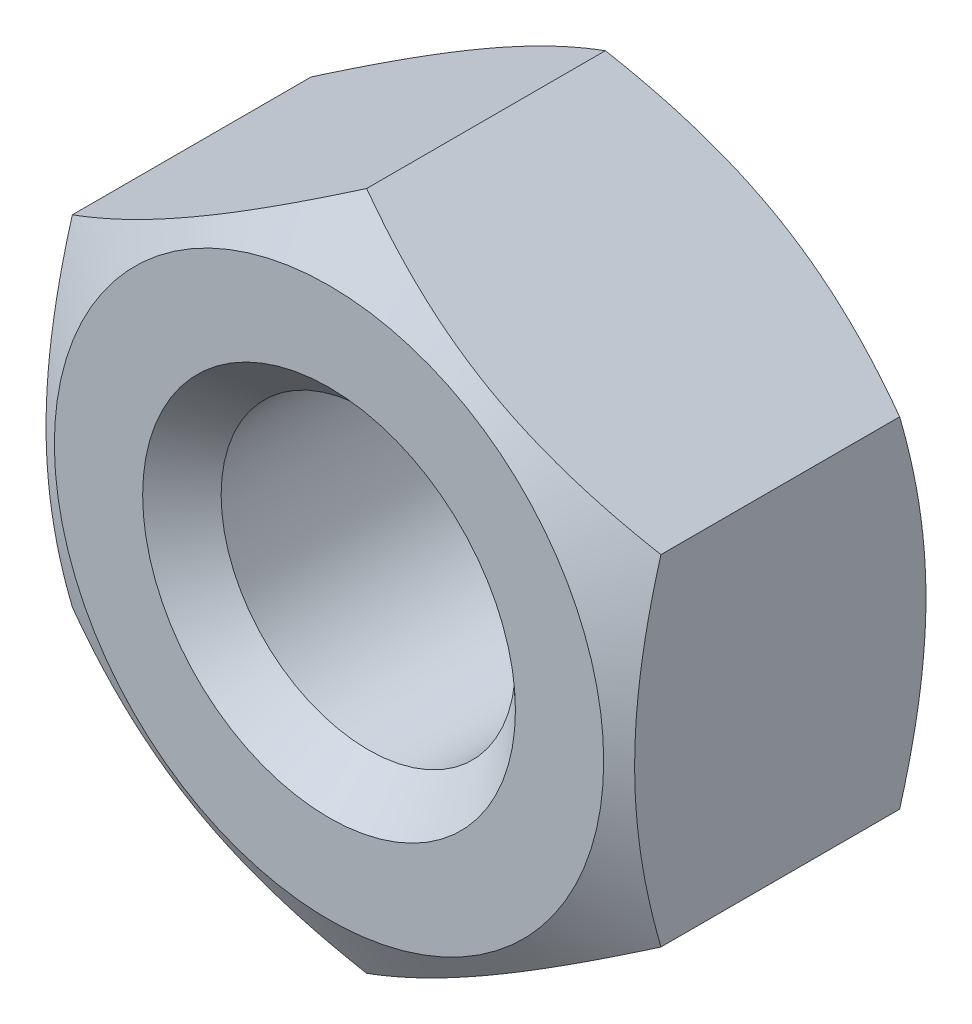
ISO-10303-21;
HEADER;
FILE_DESCRIPTION(('STEP AP214'),'2;1');
FILE_NAME('part.step','',(''),(''),'','','');
FILE_SCHEMA(('AUTOMOTIVE_DESIGN { 1 0 10303 214 1 1 1 1 }'));
ENDSEC;
DATA;
#1=APPLICATION_CONTEXT('core data for automotive mechanical design processes');
#2=APPLICATION_PROTOCOL_DEFINITION('international standard','automotive_design',2000,#1);
#3=PRODUCT_CONTEXT('',#1,'mechanical');
#4=PRODUCT('Part','Part','',(#3));
#5=PRODUCT_RELATED_PRODUCT_CATEGORY('part','',(#4));
#6=PRODUCT_DEFINITION_FORMATION('','',#4);
#7=PRODUCT_DEFINITION_CONTEXT('part definition',#1,'design');
#8=PRODUCT_DEFINITION('design','',#6,#7);
#9=PRODUCT_DEFINITION_SHAPE('','',#8);
#10=(LENGTH_UNIT() NAMED_UNIT(*) SI_UNIT(.MILLI.,.METRE.));
#11=(NAMED_UNIT(*) PLANE_ANGLE_UNIT() SI_UNIT($,.RADIAN.));
#12=(NAMED_UNIT(*) SI_UNIT($,.STERADIAN.) SOLID_ANGLE_UNIT());
#13=UNCERTAINTY_MEASURE_WITH_UNIT(LENGTH_MEASURE(1.E-05),#10,'distance_accuracy_value','');
#14=(GEOMETRIC_REPRESENTATION_CONTEXT(3) GLOBAL_UNCERTAINTY_ASSIGNED_CONTEXT((#13)) GLOBAL_UNIT_ASSIGNED_CONTEXT((#10,
#11,#12)) REPRESENTATION_CONTEXT('',''));
#15=CARTESIAN_POINT('',(0.,0.,0.));
#16=DIRECTION('',(0.,0.,1.));
#17=DIRECTION('',(1.,0.,0.));
#18=AXIS2_PLACEMENT_3D('',#15,#16,#17);
#19=CARTESIAN_POINT('',(0.,0.,0.));
#20=DIRECTION('',(0.,0.,-1.));
#21=DIRECTION('',(-1.00000000000015,0.,0.));
#22=AXIS2_PLACEMENT_3D('',#19,#20,#21);
#23=PLANE('',#22);
#24=CARTESIAN_POINT('',(0.,0.,0.));
#25=DIRECTION('',(0.,0.,-1.));
#26=DIRECTION('',(-1.00000000000015,0.,0.));
#27=AXIS2_PLACEMENT_3D('',#24,#25,#26);
#28=CIRCLE('',#27,1.9);
#29=CARTESIAN_POINT('',(-1.90000000000028,0.,0.));
#30=VERTEX_POINT('',#29);
#31=EDGE_CURVE('E122',#30,#30,#28,.T.);
#32=ORIENTED_EDGE('',*,*,#31,.T.);
#33=EDGE_LOOP('',(#32));
#34=FACE_BOUND('',#33,.T.);
#35=CARTESIAN_POINT('',(0.,0.,0.));
#36=DIRECTION('',(0.,0.,1.));
#37=DIRECTION('',(1.00000000000015,0.,0.));
#38=AXIS2_PLACEMENT_3D('',#35,#36,#37);
#39=CIRCLE('',#38,2.8);
#40=CARTESIAN_POINT('',(2.80000000000041,0.,0.));
#41=VERTEX_POINT('',#40);
#42=EDGE_CURVE('E243',#41,#41,#39,.T.);
#43=ORIENTED_EDGE('',*,*,#42,.T.);
#44=EDGE_LOOP('',(#43));
#45=FACE_BOUND('',#44,.T.);
#46=ADVANCED_FACE('F35',(#34,#45),#23,.F.);
#47=CARTESIAN_POINT('',(-1.2490009027033E-12,-7.19910242530375E-13,-3.20000000000001));
#48=DIRECTION('',(0.,0.,1.));
#49=DIRECTION('',(1.00000000000015,0.,0.));
#50=AXIS2_PLACEMENT_3D('',#47,#48,#49);
#51=PLANE('',#50);
#52=CARTESIAN_POINT('',(-1.2490009027033E-12,-7.19910242530375E-13,-3.20000000000001));
#53=DIRECTION('',(0.,0.,1.));
#54=DIRECTION('',(1.00000000000015,0.,0.));
#55=AXIS2_PLACEMENT_3D('',#52,#53,#54);
#56=CIRCLE('',#55,1.9);
#57=CARTESIAN_POINT('',(1.89999999999903,-7.18802795063311E-13,-3.20000000000001));
#58=VERTEX_POINT('',#57);
#59=EDGE_CURVE('E12',#58,#58,#56,.T.);
#60=ORIENTED_EDGE('',*,*,#59,.T.);
#61=EDGE_LOOP('',(#60));
#62=FACE_BOUND('',#61,.T.);
#63=CARTESIAN_POINT('',(-1.2490009027033E-12,-7.19910242530375E-13,-3.20000000000001));
#64=DIRECTION('',(0.,0.,1.));
#65=DIRECTION('',(1.00000000000015,0.,0.));
#66=AXIS2_PLACEMENT_3D('',#63,#64,#65);
#67=CIRCLE('',#66,2.8);
#68=CARTESIAN_POINT('',(2.79999999999917,-7.18278214684176E-13,-3.20000000000001));
#69=VERTEX_POINT('',#68);
#70=EDGE_CURVE('E242',#69,#69,#67,.T.);
#71=ORIENTED_EDGE('',*,*,#70,.F.);
#72=EDGE_LOOP('',(#71));
#73=FACE_BOUND('',#72,.T.);
#74=ADVANCED_FACE('F208',(#62,#73),#51,.F.);
#75=CARTESIAN_POINT('',(-1.2490009027033E-12,-7.19910242530375E-13,-3.20000000000001));
#76=DIRECTION('',(0.,0.,1.));
#77=DIRECTION('',(1.00000000000015,0.,0.));
#78=AXIS2_PLACEMENT_3D('',#75,#76,#77);
#79=CYLINDRICAL_SURFACE('',#78,1.5);
#80=CARTESIAN_POINT('',(0.,0.,-0.399999999999984));
#81=DIRECTION('',(0.,0.,-1.));
#82=DIRECTION('',(-1.00000000000015,0.,0.));
#83=AXIS2_PLACEMENT_3D('',#80,#81,#82);
#84=CIRCLE('',#83,1.5);
#85=CARTESIAN_POINT('',(-1.50000000000022,0.,-0.399999999999984));
#86=VERTEX_POINT('',#85);
#87=EDGE_CURVE('E43',#86,#86,#84,.F.);
#88=ORIENTED_EDGE('',*,*,#87,.T.);
#89=EDGE_LOOP('',(#88));
#90=FACE_BOUND('',#89,.T.);
#91=CARTESIAN_POINT('',(-2.91433543964104E-12,1.38777878078145E-12,-2.8));
#92=DIRECTION('',(0.,0.,1.));
#93=DIRECTION('',(1.00000000000015,0.,0.));
#94=AXIS2_PLACEMENT_3D('',#91,#92,#93);
#95=CIRCLE('',#94,1.5);
#96=CARTESIAN_POINT('',(1.49999999999731,1.38865308141334E-12,-2.8));
#97=VERTEX_POINT('',#96);
#98=EDGE_CURVE('E234',#97,#97,#95,.F.);
#99=ORIENTED_EDGE('',*,*,#98,.T.);
#100=EDGE_LOOP('',(#99));
#101=FACE_BOUND('',#100,.T.);
#102=ADVANCED_FACE('F205',(#90,#101),#79,.F.);
#103=CARTESIAN_POINT('',(-2.91433543964104E-12,1.38777878078145E-12,-2.81658075373095));
#104=DIRECTION('',(0.,0.,1.));
#105=DIRECTION('',(1.00000000000015,0.,0.));
#106=AXIS2_PLACEMENT_3D('',#103,#104,#105);
#107=CONICAL_SURFACE('',#106,3.46410161513776,1.0471975511966);
#108=ORIENTED_EDGE('',*,*,#70,.T.);
#109=EDGE_LOOP('',(#108));
#110=FACE_BOUND('',#109,.T.);
#111=CARTESIAN_POINT('',(-0.000200000000505351,-3.46421708519094,-2.8165140837311));
#112=CARTESIAN_POINT('',(0.131635206586424,-3.38810199317681,-2.86047624171016));
#113=CARTESIAN_POINT('',(0.264608405352933,-3.31132988107363,-2.90045835986991));
#114=CARTESIAN_POINT('',(0.532857419999334,-3.15645624025793,-2.97024786571702));
#115=CARTESIAN_POINT('',(0.668138002631622,-3.07835195945963,-3.00003056389698));
#116=CARTESIAN_POINT('',(0.937022602092664,-2.92311136357846,-3.04639210695105));
#117=CARTESIAN_POINT('',(1.07058524542457,-2.8459989354952,-3.06327950503942));
#118=CARTESIAN_POINT('',(1.33833905729256,-2.69141120014185,-3.0834403037137));
#119=CARTESIAN_POINT('',(1.47252925247954,-2.61393645483512,-3.08673039838093));
#120=CARTESIAN_POINT('',(1.72327559769503,-2.46916798492557,-3.07988941527675));
#121=CARTESIAN_POINT('',(1.83986926496939,-2.40185259973261,-3.07143803196976));
#122=CARTESIAN_POINT('',(2.07229698496979,-2.26766039301866,-3.04465100315551));
#123=CARTESIAN_POINT('',(2.18813023364743,-2.20078403571524,-3.02630620530075));
#124=CARTESIAN_POINT('',(2.42103725705337,-2.06631510305682,-2.98044519530902));
#125=CARTESIAN_POINT('',(2.53808155051088,-1.9987395487214,-2.95273456089922));
#126=CARTESIAN_POINT('',(2.77042435049651,-1.8645963706055,-2.8898421510248));
#127=CARTESIAN_POINT('',(2.885725834169,-1.79802702796991,-2.85467515514058));
#128=CARTESIAN_POINT('',(3.00019999999948,-1.7319353375156,-2.81651408373104));
#129=B_SPLINE_CURVE_WITH_KNOTS('',3,(#111,#112,#113,#114,#115,#116,#117,#118,#119,#120,#121,
#122,#123,#124,#125,#126,#127,#128),.UNSPECIFIED.,.F.,.F.,(4,2,2,2,2,2,2,2,4),(0.,
0.475539830102213,0.952222784106223,1.41710776961029,1.88142182297686,2.28572436315824,
2.69040156474842,3.10405572063451,3.51689749407022),.UNSPECIFIED.);
#130=CARTESIAN_POINT('',(-3.02535774210355E-12,-3.46410161513691,-2.81658075373095));
#131=VERTEX_POINT('',#130);
#132=CARTESIAN_POINT('',(2.99999999999998,-1.73205080756907,-2.81658075373095));
#133=VERTEX_POINT('',#132);
#134=EDGE_CURVE('E246',#131,#133,#129,.T.);
#135=ORIENTED_EDGE('',*,*,#134,.F.);
#136=CARTESIAN_POINT('',(-3.00020000000109,-1.7319353375129,-2.81651408373104));
#137=CARTESIAN_POINT('',(-2.86836479341274,-1.80805042952527,-2.86047624171042));
#138=CARTESIAN_POINT('',(-2.73539159464588,-1.8848225416286,-2.90045835987033));
#139=CARTESIAN_POINT('',(-2.4671425799991,-2.0396961824452,-2.97024786571762));
#140=CARTESIAN_POINT('',(-2.33186199736679,-2.11780046324424,-3.0000305638976));
#141=CARTESIAN_POINT('',(-2.06297739790416,-2.27304105912422,-3.04639210695175));
#142=CARTESIAN_POINT('',(-1.92941475457074,-2.35015348720562,-3.06327950504018));
#143=CARTESIAN_POINT('',(-1.66166094270534,-2.50474122256503,-3.08344030371415));
#144=CARTESIAN_POINT('',(-1.52747074752247,-2.58221596787967,-3.08673039838102));
#145=CARTESIAN_POINT('',(-1.27672440230623,-2.72698443778809,-3.07988941527665));
#146=CARTESIAN_POINT('',(-1.16013073502817,-2.79429982297402,-3.07143803196982));
#147=CARTESIAN_POINT('',(-0.927703015025435,-2.92849202968265,-3.04465100315563));
#148=CARTESIAN_POINT('',(-0.811869766349163,-2.99536838698777,-3.02630620530079));
#149=CARTESIAN_POINT('',(-0.578962742944541,-3.12983731964713,-2.98044519530902));
#150=CARTESIAN_POINT('',(-0.46191844948695,-3.19741287398173,-2.95273456089928));
#151=CARTESIAN_POINT('',(-0.229575649501911,-3.33155605209731,-2.88984215102494));
#152=CARTESIAN_POINT('',(-0.114274165830091,-3.3981253947334,-2.85467515514074));
#153=CARTESIAN_POINT('',(0.000199999998201639,-3.46421708519079,-2.8165140837311));
#154=B_SPLINE_CURVE_WITH_KNOTS('',3,(#136,#137,#138,#139,#140,#141,#142,#143,#144,#145,#146,
#147,#148,#149,#150,#151,#152,#153),.UNSPECIFIED.,.F.,.F.,(4,2,2,2,2,2,2,2,4),(0.,
0.475539830103452,0.952222784108633,1.41710776961384,1.88142182298158,2.28572436316202,
2.69040156475124,3.10405572063631,3.51689749407104),.UNSPECIFIED.);
#155=CARTESIAN_POINT('',(-3.0000000000015,-1.73205080756687,-2.81658075373095));
#156=VERTEX_POINT('',#155);
#157=EDGE_CURVE('E191',#156,#131,#154,.T.);
#158=ORIENTED_EDGE('',*,*,#157,.F.);
#159=CARTESIAN_POINT('',(-3.00000000000145,-4.57765749511687,-1.65667842704484));
#160=CARTESIAN_POINT('',(-3.0000000000015,-4.44606427833543,-1.72020492915937));
#161=CARTESIAN_POINT('',(-3.00000000000152,-4.31415811418956,-1.78309500271883));
#162=CARTESIAN_POINT('',(-3.00000000000153,-4.04955060360331,-1.90723823648846));
#163=CARTESIAN_POINT('',(-3.00000000000153,-3.91684912259699,-1.96849110953371));
#164=CARTESIAN_POINT('',(-3.00000000000152,-3.64975690282372,-2.08932207615049));
#165=CARTESIAN_POINT('',(-3.00000000000153,-3.51536083247075,-2.14888842738215));
#166=CARTESIAN_POINT('',(-3.00000000000153,-3.24545813842675,-2.26543945696922));
#167=CARTESIAN_POINT('',(-3.00000000000153,-3.109951573615,-2.32242427116727));
#168=CARTESIAN_POINT('',(-3.00000000000153,-2.83600490472254,-2.43377106655771));
#169=CARTESIAN_POINT('',(-3.00000000000152,-2.69754903322078,-2.4880944695001));
#170=CARTESIAN_POINT('',(-3.00000000000153,-2.418998525444,-2.59244658673362));
#171=CARTESIAN_POINT('',(-3.00000000000155,-2.27890370825794,-2.64247482173243));
#172=CARTESIAN_POINT('',(-3.00000000000151,-1.99714555154741,-2.7368806564095));
#173=CARTESIAN_POINT('',(-3.00000000000144,-1.85548632687972,-2.7812704106576));
#174=CARTESIAN_POINT('',(-3.00000000000161,-1.57015481262822,-2.86294732647327));
#175=CARTESIAN_POINT('',(-3.00000000000183,-1.42648317933591,-2.90023674827005));
#176=CARTESIAN_POINT('',(-3.00000000000183,-1.13702234190613,-2.9658940729883));
#177=CARTESIAN_POINT('',(-3.00000000000161,-0.991232392231981,-2.99425875119487));
#178=CARTESIAN_POINT('',(-3.00000000000145,-0.697912819732321,-3.04014317644817));
#179=CARTESIAN_POINT('',(-3.00000000000151,-0.550383192374841,-3.05766289523677));
#180=CARTESIAN_POINT('',(-3.00000000000155,-0.255278853966281,-3.08030714442248));
#181=CARTESIAN_POINT('',(-3.00000000000153,-0.107710188699163,-3.08550846769668));
#182=CARTESIAN_POINT('',(-3.00000000000153,0.187297365842236,-3.08324668788049));
#183=CARTESIAN_POINT('',(-3.00000000000156,0.334736278512527,-3.07578679048925));
#184=CARTESIAN_POINT('',(-3.00000000000155,0.586954835131567,-3.05271713094714));
#185=CARTESIAN_POINT('',(-3.00000000000154,0.692014181849801,-3.0400065707226));
#186=CARTESIAN_POINT('',(-3.00000000000152,0.901310176422364,-3.00899150516465));
#187=CARTESIAN_POINT('',(-3.00000000000153,1.00554669773543,-2.99068615597004));
#188=CARTESIAN_POINT('',(-3.00000000000153,1.31718924319225,-2.9282897762209));
#189=CARTESIAN_POINT('',(-3.00000000000153,1.52311968843158,-2.87676052617172));
#190=CARTESIAN_POINT('',(-3.00000000000153,1.83112795815375,-2.78804538997541));
#191=CARTESIAN_POINT('',(-3.00000000000153,1.93481734916386,-2.75614146716544));
#192=CARTESIAN_POINT('',(-3.00000000000153,2.14119424047152,-2.68918565647907));
#193=CARTESIAN_POINT('',(-3.00000000000152,2.24388165015759,-2.65413348677146));
#194=CARTESIAN_POINT('',(-3.00000000000154,2.44774194404171,-2.58162985632623));
#195=CARTESIAN_POINT('',(-3.00000000000155,2.54892011094915,-2.54419309966778));
#196=CARTESIAN_POINT('',(-3.00000000000151,2.75041771709734,-2.46717289178836));
#197=CARTESIAN_POINT('',(-3.00000000000145,2.85073744024708,-2.42759018478115));
#198=CARTESIAN_POINT('',(-3.00000000000131,2.95069606960836,-2.38713587233771));
#199=B_SPLINE_CURVE_WITH_KNOTS('',3,(#159,#160,#161,#162,#163,#164,#165,#166,#167,#168,#169,
#170,#171,#172,#173,#174,#175,#176,#177,#178,#179,#180,#181,#182,#183,#184,#185,#186,#187,#188,
#189,#190,#191,#192,#193,#194,#195,#196,#197,#198),.UNSPECIFIED.,.F.,.F.,(4,2,2,2,2,2,2,2,2,2,2,
2,2,2,2,2,2,2,2,4),(0.,0.43837969628058,0.876835786366916,1.31782905096681,1.7587990831173,
2.20493854325159,2.65112772298676,3.09633813670552,3.54140659002272,3.98663567261508,
4.43186591531249,4.8743132015646,5.31664848113509,5.63396971840568,5.95133884083178,
6.58730373269214,6.91273838994946,7.23820220922469,7.56182376655392,7.88533380132694),.UNSPECIFIED.);
#200=CARTESIAN_POINT('',(-3.00000000000161,1.73205080757159,-2.81658075373095));
#201=VERTEX_POINT('',#200);
#202=EDGE_CURVE('E185',#201,#156,#199,.F.);
#203=ORIENTED_EDGE('',*,*,#202,.F.);
#204=CARTESIAN_POINT('',(0.000199999998201639,3.46421708519352,-2.81651408373107));
#205=CARTESIAN_POINT('',(-0.131635206591242,3.38810199318231,-2.86047624170901));
#206=CARTESIAN_POINT('',(-0.26460840535848,3.3113298810793,-2.90045835986848));
#207=CARTESIAN_POINT('',(-0.532857420005614,3.15645624026276,-2.97024786571559));
#208=CARTESIAN_POINT('',(-0.668138002637909,3.07835195946345,-3.00003056389583));
#209=CARTESIAN_POINT('',(-0.937022602100865,2.92311136358358,-3.04639210694987));
#210=CARTESIAN_POINT('',(-1.07058524543463,2.84599893550254,-3.06327950503794));
#211=CARTESIAN_POINT('',(-1.33833905729955,2.69141120014201,-3.0834403037129));
#212=CARTESIAN_POINT('',(-1.47252925248162,2.61393645482588,-3.08673039838112));
#213=CARTESIAN_POINT('',(-1.72327559769774,2.46916798491782,-3.07988941527662));
#214=CARTESIAN_POINT('',(-1.83986926497628,2.40185259973334,-3.07143803196869));
#215=CARTESIAN_POINT('',(-2.07229698497911,2.26766039302592,-3.04465100315382));
#216=CARTESIAN_POINT('',(-2.18813023365501,2.20078403572053,-3.02630620529938));
#217=CARTESIAN_POINT('',(-2.42103725705916,2.06631510306113,-2.98044519530807));
#218=CARTESIAN_POINT('',(-2.53808155051666,1.99873954872676,-2.95273456089835));
#219=CARTESIAN_POINT('',(-2.77042435050133,1.86459637061136,-2.88984215102422));
#220=CARTESIAN_POINT('',(-2.88572583417287,1.79802702797524,-2.85467515514021));
#221=CARTESIAN_POINT('',(-3.00020000000062,1.73193533751727,-2.8165140837311));
#222=B_SPLINE_CURVE_WITH_KNOTS('',3,(#204,#205,#206,#207,#208,#209,#210,#211,#212,#213,#214,
#215,#216,#217,#218,#219,#220,#221),.UNSPECIFIED.,.F.,.F.,(4,2,2,2,2,2,2,2,4),(0.,
0.475539830103543,0.952222784109203,1.41710776961473,1.88142182298261,2.28572436316226,
2.69040156475081,3.10405572063528,3.51689749406917),.UNSPECIFIED.);
#223=CARTESIAN_POINT('',(-2.05391259555654E-12,3.46410161513948,-2.81658075373095));
#224=VERTEX_POINT('',#223);
#225=EDGE_CURVE('E89',#224,#201,#222,.T.);
#226=ORIENTED_EDGE('',*,*,#225,.F.);
#227=CARTESIAN_POINT('',(3.00019999999998,1.73193533751508,-2.8165140837311));
#228=CARTESIAN_POINT('',(2.86836479341166,1.80805042952815,-2.86047624170905));
#229=CARTESIAN_POINT('',(2.73539159464461,1.88482254163136,-2.90045835986848));
#230=CARTESIAN_POINT('',(2.46714257999751,2.03969618244759,-2.97024786571556));
#231=CARTESIAN_POINT('',(2.33186199736507,2.1178004632464,-3.00003056389581));
#232=CARTESIAN_POINT('',(2.06297739790292,2.27304105912726,-3.04639210695013));
#233=CARTESIAN_POINT('',(1.92941475457008,2.35015348720975,-3.06327950503845));
#234=CARTESIAN_POINT('',(1.66166094270291,2.50474122256618,-3.08344030371305));
#235=CARTESIAN_POINT('',(1.5274707475177,2.58221596787677,-3.08673039838064));
#236=CARTESIAN_POINT('',(1.27672440230175,2.72698443778583,-3.0798894152764));
#237=CARTESIAN_POINT('',(1.16013073502572,2.79429982297541,-3.07143803196913));
#238=CARTESIAN_POINT('',(0.927703015024367,2.92849202968679,-3.04465100315472));
#239=CARTESIAN_POINT('',(0.811869766347436,2.99536838699103,-3.0263062053001));
#240=CARTESIAN_POINT('',(0.578962742942159,3.12983731964974,-2.98044519530857));
#241=CARTESIAN_POINT('',(0.461918449484585,3.19741287398461,-2.95273456089883));
#242=CARTESIAN_POINT('',(0.229575649499564,3.33155605210066,-2.88984215102458));
#243=CARTESIAN_POINT('',(0.114274165827745,3.39812539473694,-2.85467515514046));
#244=CARTESIAN_POINT('',(-0.000200000000949441,3.46421708519389,-2.81651408373107));
#245=B_SPLINE_CURVE_WITH_KNOTS('',3,(#227,#228,#229,#230,#231,#232,#233,#234,#235,#236,#237,
#238,#239,#240,#241,#242,#243,#244),.UNSPECIFIED.,.F.,.F.,(4,2,2,2,2,2,2,2,4),(0.,
0.475539830103369,0.95222278410869,1.41710776961402,1.88142182298179,2.28572436316248,
2.69040156475201,3.10405572063741,3.51689749407235),.UNSPECIFIED.);
#246=CARTESIAN_POINT('',(2.99999999999945,1.73205080756869,-2.81658075373095));
#247=VERTEX_POINT('',#246);
#248=EDGE_CURVE('E86',#247,#224,#245,.T.);
#249=ORIENTED_EDGE('',*,*,#248,.F.);
#250=CARTESIAN_POINT('',(2.99999999999853,-4.57765749511828,-1.65667842704484));
#251=CARTESIAN_POINT('',(2.99999999999949,-4.44606427833647,-1.72020492915821));
#252=CARTESIAN_POINT('',(2.99999999999989,-4.31415811419053,-1.78309500271713));
#253=CARTESIAN_POINT('',(3.00000000000018,-4.04955060360438,-1.90723823648628));
#254=CARTESIAN_POINT('',(3.00000000000007,-3.91684912259824,-1.96849110953156));
#255=CARTESIAN_POINT('',(2.99999999999999,-3.64975690282511,-2.08932207614834));
#256=CARTESIAN_POINT('',(3.00000000000002,-3.51536083247211,-2.14888842737994));
#257=CARTESIAN_POINT('',(3.00000000000004,-3.24545813842808,-2.26543945696695));
#258=CARTESIAN_POINT('',(3.00000000000003,-3.10995157361633,-2.32242427116499));
#259=CARTESIAN_POINT('',(3.00000000000003,-2.83600490472392,-2.43377106655533));
#260=CARTESIAN_POINT('',(3.00000000000004,-2.6975490332222,-2.48809446949763));
#261=CARTESIAN_POINT('',(3.00000000000003,-2.41899852544551,-2.59244658673118));
#262=CARTESIAN_POINT('',(3.00000000000001,-2.2789037082595,-2.64247482173012));
#263=CARTESIAN_POINT('',(3.00000000000005,-1.997145551549,-2.73688065640669));
#264=CARTESIAN_POINT('',(3.0000000000001,-1.85548632688128,-2.78127041065417));
#265=CARTESIAN_POINT('',(2.99999999999996,-1.57015481263045,-2.86294732647127));
#266=CARTESIAN_POINT('',(2.99999999999976,-1.42648317933884,-2.9002367482701));
#267=CARTESIAN_POINT('',(2.99999999999975,-1.13702234190933,-2.96589407298829));
#268=CARTESIAN_POINT('',(2.99999999999995,-0.991232392234754,-2.99425875119274));
#269=CARTESIAN_POINT('',(3.00000000000011,-0.697912819734695,-3.04014317644469));
#270=CARTESIAN_POINT('',(3.00000000000009,-0.550383192377245,-3.05766289523404));
#271=CARTESIAN_POINT('',(2.99999999999998,-0.255278853968638,-3.08030714441989));
#272=CARTESIAN_POINT('',(2.99999999999989,-0.107710188701443,-3.08550846769348));
#273=CARTESIAN_POINT('',(3.00000000000016,0.187297365840169,-3.08324668787872));
#274=CARTESIAN_POINT('',(3.00000000000052,0.334736278510594,-3.07578679048953));
#275=CARTESIAN_POINT('',(3.0000000000004,0.586954835129402,-3.05271713094695));
#276=CARTESIAN_POINT('',(3.00000000000013,0.692014181847368,-3.04000657072103));
#277=CARTESIAN_POINT('',(2.99999999999993,0.901310176419646,-3.00899150516215));
#278=CARTESIAN_POINT('',(2.99999999999999,1.00554669773269,-2.99068615596798));
#279=CARTESIAN_POINT('',(3.0000000000001,1.31718924318952,-2.92828977621963));
#280=CARTESIAN_POINT('',(3.00000000000005,1.52311968842883,-2.87676052617029));
#281=CARTESIAN_POINT('',(3.00000000000002,1.83112795815101,-2.78804538997406));
#282=CARTESIAN_POINT('',(3.00000000000002,1.93481734916114,-2.75614146716418));
#283=CARTESIAN_POINT('',(3.00000000000004,2.14119424046887,-2.68918565647794));
#284=CARTESIAN_POINT('',(3.00000000000006,2.24388165015498,-2.65413348677038));
#285=CARTESIAN_POINT('',(3.,2.44774194403905,-2.58162985632525));
#286=CARTESIAN_POINT('',(2.99999999999993,2.5489201109464,-2.54419309966685));
#287=CARTESIAN_POINT('',(3.00000000000013,2.75041771709446,-2.4671728917877));
#288=CARTESIAN_POINT('',(3.0000000000004,2.85073744024417,-2.42759018478073));
#289=CARTESIAN_POINT('',(3.00000000000106,2.95069606960549,-2.38713587233771));
#290=B_SPLINE_CURVE_WITH_KNOTS('',3,(#250,#251,#252,#253,#254,#255,#256,#257,#258,#259,#260,
#261,#262,#263,#264,#265,#266,#267,#268,#269,#270,#271,#272,#273,#274,#275,#276,#277,#278,#279,
#280,#281,#282,#283,#284,#285,#286,#287,#288,#289),.UNSPECIFIED.,.F.,.F.,(4,2,2,2,2,2,2,2,2,2,2,
2,2,2,2,2,2,2,2,4),(0.,0.438379696280078,0.876835786365993,1.31782905096591,1.75879908311638,
2.20493854325047,2.65112772298557,3.09633813670397,3.54140659002057,3.98663567261295,
4.4318659153106,4.87431320156297,5.31664848113346,5.6339697184037,5.95133884082959,
6.58730373268987,6.9127383899472,7.23820220922249,7.56182376655143,7.88533380132408),.UNSPECIFIED.);
#291=EDGE_CURVE('E58',#133,#247,#290,.T.);
#292=ORIENTED_EDGE('',*,*,#291,.F.);
#293=EDGE_LOOP('',(#135,#158,#203,#226,#249,#292));
#294=FACE_BOUND('',#293,.T.);
#295=ADVANCED_FACE('F87',(#110,#294),#107,.T.);
#296=CARTESIAN_POINT('',(-2.52575738102223E-12,-3.46410161513556,-17.483556979968));
#297=DIRECTION('',(0.500000000000069,-0.866025403784565,0.));
#298=DIRECTION('',(0.866025403784565,0.500000000000069,0.));
#299=AXIS2_PLACEMENT_3D('',#296,#297,#298);
#300=PLANE('',#299);
#301=DIRECTION('',(0.,0.,1.));
#302=VECTOR('',#301,1.);
#303=CARTESIAN_POINT('',(3.00000000000003,-1.73205080756807,-17.4835569799682));
#304=LINE('',#303,#302);
#305=CARTESIAN_POINT('',(2.99999999999986,-1.73205080756966,-0.383419246269029));
#306=VERTEX_POINT('',#305);
#307=EDGE_CURVE('E102',#133,#306,#304,.T.);
#308=ORIENTED_EDGE('',*,*,#307,.T.);
#309=CARTESIAN_POINT('',(3.00019999999979,-1.73193533751594,-0.383485916268939));
#310=CARTESIAN_POINT('',(2.86836479341019,-1.80805042952604,-0.339523758288947));
#311=CARTESIAN_POINT('',(2.73539159464275,-1.88482254162839,-0.299541640128838));
#312=CARTESIAN_POINT('',(2.46714257999551,-2.03969618244422,-0.229752134281425));
#313=CARTESIAN_POINT('',(2.33186199736332,-2.11780046324348,-0.199969436101512));
#314=CARTESIAN_POINT('',(2.06297739790088,-2.27304105912379,-0.15360789304715));
#315=CARTESIAN_POINT('',(1.92941475456752,-2.35015348720531,-0.136720494958452));
#316=CARTESIAN_POINT('',(1.66166094270174,-2.50474122256418,-0.116559696285073));
#317=CARTESIAN_POINT('',(1.52747074751842,-2.58221596787816,-0.113269601619072));
#318=CARTESIAN_POINT('',(1.27672440230221,-2.72698443778672,-0.12011058472329));
#319=CARTESIAN_POINT('',(1.16013073502452,-2.79429982297327,-0.128561968029319));
#320=CARTESIAN_POINT('',(0.927703015022162,-2.92849202968232,-0.155348996842924));
#321=CARTESIAN_POINT('',(0.811869766345894,-2.99536838698725,-0.173693794697982));
#322=CARTESIAN_POINT('',(0.578962742941308,-3.12983731964632,-0.219554804689814));
#323=CARTESIAN_POINT('',(0.461918449483748,-3.19741287398082,-0.247265439099392));
#324=CARTESIAN_POINT('',(0.229575649499076,-3.33155605209663,-0.31015784897387));
#325=CARTESIAN_POINT('',(0.114274165827593,-3.39812539473304,-0.345324844858367));
#326=CARTESIAN_POINT('',(-0.000200000000005751,-3.46421708519109,-0.383485916268939));
#327=B_SPLINE_CURVE_WITH_KNOTS('',3,(#309,#310,#311,#312,#313,#314,#315,#316,#317,#318,#319,
#320,#321,#322,#323,#324,#325,#326),.UNSPECIFIED.,.F.,.F.,(4,2,2,2,2,2,2,2,4),(0.,
0.475539830103678,0.952222784108829,1.41710776961408,1.88142182298198,2.28572436316227,
2.69040156475123,3.10405572063598,3.51689749407059),.UNSPECIFIED.);
#328=CARTESIAN_POINT('',(-4.9960036108132E-13,-3.46410161513723,-0.383419246269084));
#329=VERTEX_POINT('',#328);
#330=EDGE_CURVE('E115',#306,#329,#327,.T.);
#331=ORIENTED_EDGE('',*,*,#330,.T.);
#332=DIRECTION('',(0.,0.,1.));
#333=VECTOR('',#332,1.);
#334=CARTESIAN_POINT('',(-2.52575738102223E-12,-3.46410161513556,-17.483556979968));
#335=LINE('',#334,#333);
#336=EDGE_CURVE('E123',#131,#329,#335,.T.);
#337=ORIENTED_EDGE('',*,*,#336,.F.);
#338=ORIENTED_EDGE('',*,*,#134,.T.);
#339=EDGE_LOOP('',(#308,#331,#337,#338));
#340=FACE_BOUND('',#339,.T.);
#341=ADVANCED_FACE('F125',(#340),#300,.T.);
#342=CARTESIAN_POINT('',(-3.00000000000147,-1.73205080756693,-17.4835569799681));
#343=DIRECTION('',(-0.500000000000072,-0.866025403784567,0.));
#344=DIRECTION('',(0.866025403784567,-0.500000000000072,0.));
#345=AXIS2_PLACEMENT_3D('',#342,#343,#344);
#346=PLANE('',#345);
#347=ORIENTED_EDGE('',*,*,#336,.T.);
#348=CARTESIAN_POINT('',(0.000199999999533906,-3.46421708519054,-0.383485916268939));
#349=CARTESIAN_POINT('',(-0.131635206588504,-3.38810199317778,-0.339523758289769));
#350=CARTESIAN_POINT('',(-0.264608405355419,-3.31132988107475,-0.299541640129919));
#351=CARTESIAN_POINT('',(-0.532857420002301,-3.15645624025874,-0.229752134282656));
#352=CARTESIAN_POINT('',(-0.668138002634665,-3.07835195945998,-0.199969436102642));
#353=CARTESIAN_POINT('',(-0.937022602096571,-2.92311136357917,-0.153607893048546));
#354=CARTESIAN_POINT('',(-1.07058524542924,-2.8459989354967,-0.136720494960201));
#355=CARTESIAN_POINT('',(-1.33833905729628,-2.6914112001406,-0.11655969628593));
#356=CARTESIAN_POINT('',(-1.47252925248154,-2.61393645483033,-0.113269601618682));
#357=CARTESIAN_POINT('',(-1.72327559769734,-2.46916798492129,-0.120110584723013));
#358=CARTESIAN_POINT('',(-1.83986926497322,-2.40185259973148,-0.128561968030108));
#359=CARTESIAN_POINT('',(-2.07229698497444,-2.26766039301997,-0.155348996844463));
#360=CARTESIAN_POINT('',(-2.18813023365138,-2.20078403571583,-0.173693794699206));
#361=CARTESIAN_POINT('',(-2.4210372570566,-2.06631510305716,-0.219554804690879));
#362=CARTESIAN_POINT('',(-2.53808155051411,-1.99873954872223,-0.247265439100626));
#363=CARTESIAN_POINT('',(-2.77042435049917,-1.86459637060635,-0.310157848975022));
#364=CARTESIAN_POINT('',(-2.88572583417109,-1.7980270279703,-0.345324844859266));
#365=CARTESIAN_POINT('',(-3.00020000000006,-1.73193533751398,-0.383485916268939));
#366=B_SPLINE_CURVE_WITH_KNOTS('',3,(#348,#349,#350,#351,#352,#353,#354,#355,#356,#357,#358,
#359,#360,#361,#362,#363,#364,#365),.UNSPECIFIED.,.F.,.F.,(4,2,2,2,2,2,2,2,4),(0.,
0.475539830103089,0.952222784107993,1.41710776961288,1.88142182298025,2.28572436316089,
2.69040156475032,3.10405572063567,3.51689749407062),.UNSPECIFIED.);
#367=CARTESIAN_POINT('',(-3.00000000000153,-1.73205080756814,-0.383419246269029));
#368=VERTEX_POINT('',#367);
#369=EDGE_CURVE('E50',#329,#368,#366,.T.);
#370=ORIENTED_EDGE('',*,*,#369,.T.);
#371=DIRECTION('',(0.,0.,1.));
#372=VECTOR('',#371,1.);
#373=CARTESIAN_POINT('',(-3.00000000000147,-1.73205080756693,-17.4835569799681));
#374=LINE('',#373,#372);
#375=EDGE_CURVE('E257',#156,#368,#374,.T.);
#376=ORIENTED_EDGE('',*,*,#375,.F.);
#377=ORIENTED_EDGE('',*,*,#157,.T.);
#378=EDGE_LOOP('',(#347,#370,#376,#377));
#379=FACE_BOUND('',#378,.T.);
#380=ADVANCED_FACE('F199',(#379),#346,.T.);
#381=CARTESIAN_POINT('',(-3.00000000000153,1.73205080757105,-17.4835569799681));
#382=DIRECTION('',(-1.00000000000015,0.,0.));
#383=DIRECTION('',(0.,0.,1.));
#384=AXIS2_PLACEMENT_3D('',#381,#382,#383);
#385=PLANE('',#384);
#386=ORIENTED_EDGE('',*,*,#375,.T.);
#387=CARTESIAN_POINT('',(-3.00000000000153,-4.57765749511665,-1.5433215729552));
#388=CARTESIAN_POINT('',(-3.00000000000153,-4.4460642783353,-1.4797950708408));
#389=CARTESIAN_POINT('',(-3.00000000000153,-4.31415811418953,-1.41690499728146));
#390=CARTESIAN_POINT('',(-3.00000000000153,-4.0495506036035,-1.292761763512));
#391=CARTESIAN_POINT('',(-3.00000000000153,-3.91684912259729,-1.23150889046682));
#392=CARTESIAN_POINT('',(-3.00000000000153,-3.64975690282414,-1.11067792385015));
#393=CARTESIAN_POINT('',(-3.00000000000153,-3.5153608324712,-1.05111157261854));
#394=CARTESIAN_POINT('',(-3.00000000000153,-3.24545813842725,-0.934560543031542));
#395=CARTESIAN_POINT('',(-3.00000000000153,-3.10995157361553,-0.87757572883354));
#396=CARTESIAN_POINT('',(-3.00000000000152,-2.83600490472315,-0.766228933443219));
#397=CARTESIAN_POINT('',(-3.00000000000151,-2.69754903322145,-0.711905530500907));
#398=CARTESIAN_POINT('',(-3.00000000000155,-2.41899852544477,-0.607553413267438));
#399=CARTESIAN_POINT('',(-3.0000000000016,-2.27890370825875,-0.557525178268584));
#400=CARTESIAN_POINT('',(-3.00000000000146,-1.9971455515483,-0.463119343591867));
#401=CARTESIAN_POINT('',(-3.00000000000126,-1.85548632688062,-0.418729589344156));
#402=CARTESIAN_POINT('',(-3.0000000000018,-1.57015481262957,-0.337052673527753));
#403=CARTESIAN_POINT('',(-3.00000000000253,-1.42648317933768,-0.29976325172986));
#404=CARTESIAN_POINT('',(-3.00000000000253,-1.13702234190789,-0.234105927011677));
#405=CARTESIAN_POINT('',(-3.00000000000179,-0.991232392233316,-0.20574124880631));
#406=CARTESIAN_POINT('',(-3.00000000000127,-0.697912819733036,-0.159856823553776));
#407=CARTESIAN_POINT('',(-3.00000000000149,-0.550383192375367,-0.142337104764752));
#408=CARTESIAN_POINT('',(-3.00000000000157,-0.255278853966394,-0.119692855579171));
#409=CARTESIAN_POINT('',(-3.00000000000143,-0.107710188699051,-0.11449153230553));
#410=CARTESIAN_POINT('',(-3.00000000000163,0.187297365842856,-0.116753312120704));
#411=CARTESIAN_POINT('',(-3.00000000000198,0.33473627851343,-0.124213209510365));
#412=CARTESIAN_POINT('',(-3.00000000000188,0.586954835132354,-0.147282869053074));
#413=CARTESIAN_POINT('',(-3.00000000000162,0.692014181850276,-0.159993429278829));
#414=CARTESIAN_POINT('',(-3.00000000000143,0.90131017642242,-0.191008494837668));
#415=CARTESIAN_POINT('',(-3.0000000000015,1.00554669773538,-0.209313844031966));
#416=CARTESIAN_POINT('',(-3.00000000000159,1.31718924319192,-0.271710223780576));
#417=CARTESIAN_POINT('',(-3.00000000000155,1.52311968843104,-0.323239473829942));
#418=CARTESIAN_POINT('',(-3.00000000000152,1.83112795815293,-0.411954610026238));
#419=CARTESIAN_POINT('',(-3.00000000000152,1.93481734916297,-0.443858532836147));
#420=CARTESIAN_POINT('',(-3.00000000000154,2.1411942404705,-0.510814343522407));
#421=CARTESIAN_POINT('',(-3.00000000000155,2.24388165015652,-0.545866513229966));
#422=CARTESIAN_POINT('',(-3.00000000000151,2.44774194404041,-0.618370143675136));
#423=CARTESIAN_POINT('',(-3.00000000000145,2.54892011094768,-0.655806900333574));
#424=CARTESIAN_POINT('',(-3.00000000000161,2.75041771709563,-0.732827108212656));
#425=CARTESIAN_POINT('',(-3.00000000000182,2.85073744024532,-0.772409815219533));
#426=CARTESIAN_POINT('',(-3.00000000000233,2.95069606960667,-0.812864127662294));
#427=B_SPLINE_CURVE_WITH_KNOTS('',3,(#387,#388,#389,#390,#391,#392,#393,#394,#395,#396,#397,
#398,#399,#400,#401,#402,#403,#404,#405,#406,#407,#408,#409,#410,#411,#412,#413,#414,#415,#416,
#417,#418,#419,#420,#421,#422,#423,#424,#425,#426),.UNSPECIFIED.,.F.,.F.,(4,2,2,2,2,2,2,2,2,2,2,
2,2,2,2,2,2,2,2,4),(0.,0.43837969628016,0.876835786366114,1.3178290509659,1.75879908311625,
2.20493854325032,2.65112772298534,3.09633813670378,3.54140659002052,3.98663567261345,
4.43186591531159,4.87431320156441,5.31664848113542,5.63396971840548,5.95133884083116,
6.58730373269094,6.91273838994801,7.23820220922302,7.56182376655177,7.88533380132425),.UNSPECIFIED.);
#428=CARTESIAN_POINT('',(-3.00000000000161,1.73205080757047,-0.383419246269084));
#429=VERTEX_POINT('',#428);
#430=EDGE_CURVE('E148',#368,#429,#427,.T.);
#431=ORIENTED_EDGE('',*,*,#430,.T.);
#432=DIRECTION('',(0.,0.,1.));
#433=VECTOR('',#432,1.);
#434=CARTESIAN_POINT('',(-3.00000000000153,1.73205080757105,-17.4835569799681));
#435=LINE('',#434,#433);
#436=EDGE_CURVE('E109',#201,#429,#435,.T.);
#437=ORIENTED_EDGE('',*,*,#436,.F.);
#438=ORIENTED_EDGE('',*,*,#202,.T.);
#439=EDGE_LOOP('',(#386,#431,#437,#438));
#440=FACE_BOUND('',#439,.T.);
#441=ADVANCED_FACE('F196',(#440),#385,.T.);
#442=CARTESIAN_POINT('',(-2.41473507855972E-12,3.46410161514138,-17.4835569799683));
#443=DIRECTION('',(-0.500000000000069,0.866025403784565,0.));
#444=DIRECTION('',(-0.866025403784565,-0.500000000000069,0.));
#445=AXIS2_PLACEMENT_3D('',#442,#443,#444);
#446=PLANE('',#445);
#447=ORIENTED_EDGE('',*,*,#436,.T.);
#448=CARTESIAN_POINT('',(-3.00020000000017,1.73193533751631,-0.383485916268938));
#449=CARTESIAN_POINT('',(-2.86836479341294,1.80805042953066,-0.339523758291813));
#450=CARTESIAN_POINT('',(-2.73539159464657,1.8848225416343,-0.299541640132673));
#451=CARTESIAN_POINT('',(-2.46714258000032,2.03969618245067,-0.229752134285863));
#452=CARTESIAN_POINT('',(-2.33186199736804,2.11780046324919,-0.199969436105603));
#453=CARTESIAN_POINT('',(-2.06297739790633,2.27304105912955,-0.153607893051884));
#454=CARTESIAN_POINT('',(-1.92941475457376,2.35015348721182,-0.136720494964138));
#455=CARTESIAN_POINT('',(-1.66166094270743,2.50474122256813,-0.116559696288334));
#456=CARTESIAN_POINT('',(-1.52747074752276,2.58221596787881,-0.113269601618949));
#457=CARTESIAN_POINT('',(-1.27672440230719,2.72698443778761,-0.120110584723413));
#458=CARTESIAN_POINT('',(-1.16013073503101,2.79429982297691,-0.128561968032272));
#459=CARTESIAN_POINT('',(-0.927703015029373,2.92849202968811,-0.155348996847797));
#460=CARTESIAN_POINT('',(-0.811869766352317,2.99536838699245,-0.17369379470195));
#461=CARTESIAN_POINT('',(-0.578962742946894,3.12983731965152,-0.219554804693234));
#462=CARTESIAN_POINT('',(-0.461918449489305,3.19741287398666,-0.247265439103202));
#463=CARTESIAN_POINT('',(-0.22957564950364,3.33155605210228,-0.310157848977275));
#464=CARTESIAN_POINT('',(-0.114274165831193,3.39812539473787,-0.345324844860966));
#465=CARTESIAN_POINT('',(0.000199999998923284,3.46421708519315,-0.383485916268939));
#466=B_SPLINE_CURVE_WITH_KNOTS('',3,(#448,#449,#450,#451,#452,#453,#454,#455,#456,#457,#458,
#459,#460,#461,#462,#463,#464,#465),.UNSPECIFIED.,.F.,.F.,(4,2,2,2,2,2,2,2,4),(0.,
0.475539830102003,0.95222278410643,1.4171077696107,1.88142182297718,2.28572436315806,
2.69040156474798,3.10405572063394,3.51689749406907),.UNSPECIFIED.);
#467=CARTESIAN_POINT('',(-1.69309011255336E-12,3.46410161513959,-0.383419246269057));
#468=VERTEX_POINT('',#467);
#469=EDGE_CURVE('E154',#429,#468,#466,.T.);
#470=ORIENTED_EDGE('',*,*,#469,.T.);
#471=DIRECTION('',(0.,0.,1.));
#472=VECTOR('',#471,1.);
#473=CARTESIAN_POINT('',(-2.41473507855972E-12,3.46410161514138,-17.4835569799683));
#474=LINE('',#473,#472);
#475=EDGE_CURVE('E107',#224,#468,#474,.T.);
#476=ORIENTED_EDGE('',*,*,#475,.F.);
#477=ORIENTED_EDGE('',*,*,#225,.T.);
#478=EDGE_LOOP('',(#447,#470,#476,#477));
#479=FACE_BOUND('',#478,.T.);
#480=ADVANCED_FACE('F170',(#479),#446,.T.);
#481=CARTESIAN_POINT('',(3.00000000000056,1.73205080756921,-17.4835569799683));
#482=DIRECTION('',(0.500000000000072,0.866025403784566,0.));
#483=DIRECTION('',(-0.866025403784566,0.500000000000072,0.));
#484=AXIS2_PLACEMENT_3D('',#481,#482,#483);
#485=PLANE('',#484);
#486=ORIENTED_EDGE('',*,*,#475,.T.);
#487=CARTESIAN_POINT('',(-0.000200000000061262,3.46421708519416,-0.383485916268939));
#488=CARTESIAN_POINT('',(0.131635206588096,3.38810199318101,-0.339523758290612));
#489=CARTESIAN_POINT('',(0.264608405354841,3.31132988107733,-0.29954164013104));
#490=CARTESIAN_POINT('',(0.532857420001556,3.15645624026043,-0.229752134283886));
#491=CARTESIAN_POINT('',(0.668138002633924,3.07835195946144,-0.199969436103705));
#492=CARTESIAN_POINT('',(0.937022602096677,2.92311136358156,-0.153607893049544));
#493=CARTESIAN_POINT('',(1.07058524543017,2.84599893550021,-0.136720494961295));
#494=CARTESIAN_POINT('',(1.33833905729546,2.69141120014053,-0.116559696286683));
#495=CARTESIAN_POINT('',(1.47252925247814,2.61393645482557,-0.113269601618996));
#496=CARTESIAN_POINT('',(1.72327559769447,2.46916798491717,-0.120110584723362));
#497=CARTESIAN_POINT('',(1.83986926497277,2.40185259973147,-0.128561968030816));
#498=CARTESIAN_POINT('',(2.07229698497582,2.26766039302295,-0.15534899684541));
#499=CARTESIAN_POINT('',(2.18813023365218,2.20078403571768,-0.173693794700036));
#500=CARTESIAN_POINT('',(2.42103725705701,2.0663151030581,-0.219554804691662));
#501=CARTESIAN_POINT('',(2.53808155051472,1.99873954872342,-0.247265439101482));
#502=CARTESIAN_POINT('',(2.77042435050006,1.86459637060779,-0.310157848975762));
#503=CARTESIAN_POINT('',(2.88572583417207,1.79802702797175,-0.345324844859812));
#504=CARTESIAN_POINT('',(3.00020000000067,1.73193533751445,-0.383485916268939));
#505=B_SPLINE_CURVE_WITH_KNOTS('',3,(#487,#488,#489,#490,#491,#492,#493,#494,#495,#496,#497,
#498,#499,#500,#501,#502,#503,#504),.UNSPECIFIED.,.F.,.F.,(4,2,2,2,2,2,2,2,4),(0.,
0.475539830103379,0.952222784108732,1.41710776961406,1.8814218229818,2.28572436316256,
2.69040156475218,3.10405572063769,3.51689749407272),.UNSPECIFIED.);
#506=CARTESIAN_POINT('',(2.99999999999948,1.73205080756789,-0.383419246269084));
#507=VERTEX_POINT('',#506);
#508=EDGE_CURVE('E106',#468,#507,#505,.T.);
#509=ORIENTED_EDGE('',*,*,#508,.T.);
#510=DIRECTION('',(0.,0.,1.));
#511=VECTOR('',#510,1.);
#512=CARTESIAN_POINT('',(3.00000000000056,1.73205080756921,-17.4835569799683));
#513=LINE('',#512,#511);
#514=EDGE_CURVE('E100',#247,#507,#513,.T.);
#515=ORIENTED_EDGE('',*,*,#514,.F.);
#516=ORIENTED_EDGE('',*,*,#248,.T.);
#517=EDGE_LOOP('',(#486,#509,#515,#516));
#518=FACE_BOUND('',#517,.T.);
#519=ADVANCED_FACE('F105',(#518),#485,.T.);
#520=CARTESIAN_POINT('',(3.00000000000003,-1.73205080756807,-17.4835569799682));
#521=DIRECTION('',(1.00000000000015,0.,0.));
#522=DIRECTION('',(0.,1.00000000000015,0.));
#523=AXIS2_PLACEMENT_3D('',#520,#521,#522);
#524=PLANE('',#523);
#525=ORIENTED_EDGE('',*,*,#514,.T.);
#526=CARTESIAN_POINT('',(2.99999999999759,-4.57765749511867,-1.5433215729552));
#527=CARTESIAN_POINT('',(2.99999999999915,-4.44606427833719,-1.47979507084105));
#528=CARTESIAN_POINT('',(2.9999999999998,-4.31415811419137,-1.41690499728179));
#529=CARTESIAN_POINT('',(3.00000000000027,-4.04955060360529,-1.29276176351236));
#530=CARTESIAN_POINT('',(3.00000000000009,-3.9168491225991,-1.23150889046714));
#531=CARTESIAN_POINT('',(2.99999999999997,-3.64975690282598,-1.11067792385041));
#532=CARTESIAN_POINT('',(3.00000000000002,-3.51536083247306,-1.05111157261879));
#533=CARTESIAN_POINT('',(3.00000000000005,-3.24545813842916,-0.934560543031771));
#534=CARTESIAN_POINT('',(3.00000000000003,-3.10995157361746,-0.877575728833748));
#535=CARTESIAN_POINT('',(3.00000000000003,-2.83600490472514,-0.766228933443378));
#536=CARTESIAN_POINT('',(3.00000000000005,-2.69754903322346,-0.711905530501035));
#537=CARTESIAN_POINT('',(3.00000000000001,-2.41899852544682,-0.607553413267519));
#538=CARTESIAN_POINT('',(2.99999999999996,-2.27890370826084,-0.557525178268649));
#539=CARTESIAN_POINT('',(3.0000000000001,-1.99714555155044,-0.463119343591808));
#540=CARTESIAN_POINT('',(3.00000000000028,-1.85548632688278,-0.418729589343989));
#541=CARTESIAN_POINT('',(2.99999999999978,-1.5701548126317,-0.337052673527649));
#542=CARTESIAN_POINT('',(2.99999999999909,-1.42648317933976,-0.299763251729927));
#543=CARTESIAN_POINT('',(2.99999999999909,-1.1370223419099,-0.234105927011594));
#544=CARTESIAN_POINT('',(2.99999999999978,-0.991232392235292,-0.20574124880591));
#545=CARTESIAN_POINT('',(3.00000000000028,-0.697912819734914,-0.159856823553115));
#546=CARTESIAN_POINT('',(3.0000000000001,-0.550383192377176,-0.142337104764146));
#547=CARTESIAN_POINT('',(2.99999999999996,-0.255278853968052,-0.11969285557833));
#548=CARTESIAN_POINT('',(3.00000000000002,-0.107710188700626,-0.114491532304401));
#549=CARTESIAN_POINT('',(3.00000000000004,0.187297365841407,-0.11675331212008));
#550=CARTESIAN_POINT('',(3.,0.334736278512023,-0.124213209510537));
#551=CARTESIAN_POINT('',(3.,0.586954835131116,-0.147282869052944));
#552=CARTESIAN_POINT('',(3.00000000000002,0.692014181849121,-0.15999342927807));
#553=CARTESIAN_POINT('',(3.00000000000004,0.901310176421329,-0.19100849483642));
#554=CARTESIAN_POINT('',(3.00000000000003,1.00554669773427,-0.209313844030859));
#555=CARTESIAN_POINT('',(3.00000000000002,1.31718924319073,-0.271710223779672));
#556=CARTESIAN_POINT('',(3.00000000000002,1.52311968842982,-0.323239473828888));
#557=CARTESIAN_POINT('',(3.00000000000003,1.83112795815164,-0.41195461002509));
#558=CARTESIAN_POINT('',(3.00000000000004,1.93481734916164,-0.44385853283499));
#559=CARTESIAN_POINT('',(3.00000000000002,2.14119424046909,-0.510814343521243));
#560=CARTESIAN_POINT('',(3.,2.24388165015505,-0.545866513228803));
#561=CARTESIAN_POINT('',(3.00000000000005,2.44774194403893,-0.618370143673887));
#562=CARTESIAN_POINT('',(3.00000000000012,2.54892011094623,-0.655806900332239));
#563=CARTESIAN_POINT('',(2.99999999999993,2.75041771709411,-0.732827108211556));
#564=CARTESIAN_POINT('',(2.99999999999967,2.85073744024368,-0.772409815218756));
#565=CARTESIAN_POINT('',(2.99999999999903,2.95069606960474,-0.812864127662294));
#566=B_SPLINE_CURVE_WITH_KNOTS('',3,(#526,#527,#528,#529,#530,#531,#532,#533,#534,#535,#536,
#537,#538,#539,#540,#541,#542,#543,#544,#545,#546,#547,#548,#549,#550,#551,#552,#553,#554,#555,
#556,#557,#558,#559,#560,#561,#562,#563,#564,#565),.UNSPECIFIED.,.F.,.F.,(4,2,2,2,2,2,2,2,2,2,2,
2,2,2,2,2,2,2,2,4),(0.,0.438379696280193,0.876835786366178,1.31782905096591,1.75879908311622,
2.20493854325025,2.65112772298523,3.09633813670368,3.54140659002045,3.98663567261364,
4.43186591531198,4.87431320156502,5.31664848113632,5.63396971840642,5.95133884083209,
6.58730373269172,6.91273838994867,7.23820220922355,7.5618237665523,7.88533380132481),.UNSPECIFIED.);
#567=EDGE_CURVE('E111',#507,#306,#566,.F.);
#568=ORIENTED_EDGE('',*,*,#567,.T.);
#569=ORIENTED_EDGE('',*,*,#307,.F.);
#570=ORIENTED_EDGE('',*,*,#291,.T.);
#571=EDGE_LOOP('',(#525,#568,#569,#570));
#572=FACE_BOUND('',#571,.T.);
#573=ADVANCED_FACE('F98',(#572),#524,.T.);
#574=CARTESIAN_POINT('',(0.,0.,0.));
#575=DIRECTION('',(0.,0.,-1.));
#576=DIRECTION('',(-1.00000000000015,0.,0.));
#577=AXIS2_PLACEMENT_3D('',#574,#575,#576);
#578=CONICAL_SURFACE('',#577,2.8,1.0471975511966);
#579=ORIENTED_EDGE('',*,*,#508,.F.);
#580=ORIENTED_EDGE('',*,*,#469,.F.);
#581=ORIENTED_EDGE('',*,*,#430,.F.);
#582=ORIENTED_EDGE('',*,*,#369,.F.);
#583=ORIENTED_EDGE('',*,*,#330,.F.);
#584=ORIENTED_EDGE('',*,*,#567,.F.);
#585=EDGE_LOOP('',(#579,#580,#581,#582,#583,#584));
#586=FACE_BOUND('',#585,.T.);
#587=ORIENTED_EDGE('',*,*,#42,.F.);
#588=EDGE_LOOP('',(#587));
#589=FACE_BOUND('',#588,.T.);
#590=ADVANCED_FACE('F129',(#586,#589),#578,.T.);
#591=CARTESIAN_POINT('',(0.,0.,0.));
#592=DIRECTION('',(0.,0.,1.));
#593=DIRECTION('',(1.00000000000015,0.,0.));
#594=AXIS2_PLACEMENT_3D('',#591,#592,#593);
#595=CONICAL_SURFACE('',#594,1.9,0.785398163397446);
#596=ORIENTED_EDGE('',*,*,#87,.F.);
#597=EDGE_LOOP('',(#596));
#598=FACE_BOUND('',#597,.T.);
#599=ORIENTED_EDGE('',*,*,#31,.F.);
#600=EDGE_LOOP('',(#599));
#601=FACE_BOUND('',#600,.T.);
#602=ADVANCED_FACE('F133',(#598,#601),#595,.F.);
#603=CARTESIAN_POINT('',(-1.2490009027033E-12,-7.19910242530375E-13,-3.20000000000001));
#604=DIRECTION('',(0.,0.,-1.));
#605=DIRECTION('',(-1.00000000000015,0.,0.));
#606=AXIS2_PLACEMENT_3D('',#603,#604,#605);
#607=CONICAL_SURFACE('',#606,1.9,0.785398163397446);
#608=ORIENTED_EDGE('',*,*,#98,.F.);
#609=EDGE_LOOP('',(#608));
#610=FACE_BOUND('',#609,.T.);
#611=ORIENTED_EDGE('',*,*,#59,.F.);
#612=EDGE_LOOP('',(#611));
#613=FACE_BOUND('',#612,.T.);
#614=ADVANCED_FACE('F37',(#610,#613),#607,.F.);
#615=CLOSED_SHELL('',(#46,#74,#102,#295,#341,#380,#441,#480,#519,#573,#590,#602,#614));
#616=MANIFOLD_SOLID_BREP('B2',#615);
#617=ADVANCED_BREP_SHAPE_REPRESENTATION('',(#18,#616),#14);
#618=SHAPE_DEFINITION_REPRESENTATION(#9,#617);
ENDSEC;
END-ISO-10303-21;
